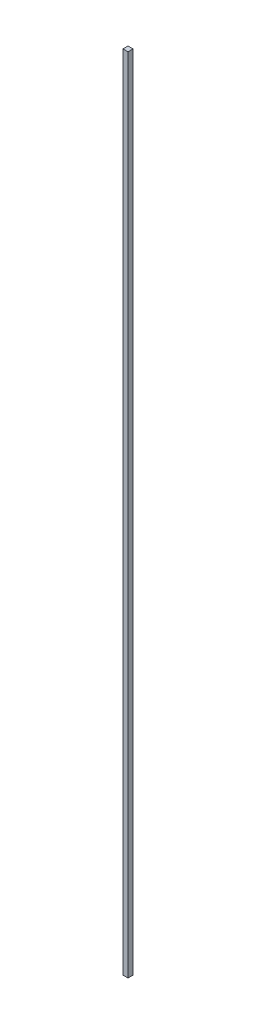
ISO-10303-21;
HEADER;
FILE_DESCRIPTION(('STEP AP214'),'2;1');
FILE_NAME('part.step','',(''),(''),'','','');
FILE_SCHEMA(('AUTOMOTIVE_DESIGN { 1 0 10303 214 1 1 1 1 }'));
ENDSEC;
DATA;
#1=APPLICATION_CONTEXT('core data for automotive mechanical design processes');
#2=APPLICATION_PROTOCOL_DEFINITION('international standard','automotive_design',2000,#1);
#3=PRODUCT_CONTEXT('',#1,'mechanical');
#4=PRODUCT('Part','Part','',(#3));
#5=PRODUCT_RELATED_PRODUCT_CATEGORY('part','',(#4));
#6=PRODUCT_DEFINITION_FORMATION('','',#4);
#7=PRODUCT_DEFINITION_CONTEXT('part definition',#1,'design');
#8=PRODUCT_DEFINITION('design','',#6,#7);
#9=PRODUCT_DEFINITION_SHAPE('','',#8);
#10=(LENGTH_UNIT() NAMED_UNIT(*) SI_UNIT(.MILLI.,.METRE.));
#11=(NAMED_UNIT(*) PLANE_ANGLE_UNIT() SI_UNIT($,.RADIAN.));
#12=(NAMED_UNIT(*) SI_UNIT($,.STERADIAN.) SOLID_ANGLE_UNIT());
#13=UNCERTAINTY_MEASURE_WITH_UNIT(LENGTH_MEASURE(1.E-05),#10,'distance_accuracy_value','');
#14=(GEOMETRIC_REPRESENTATION_CONTEXT(3) GLOBAL_UNCERTAINTY_ASSIGNED_CONTEXT((#13)) GLOBAL_UNIT_ASSIGNED_CONTEXT((#10,
#11,#12)) REPRESENTATION_CONTEXT('',''));
#15=CARTESIAN_POINT('',(0.,0.,0.));
#16=DIRECTION('',(0.,0.,1.));
#17=DIRECTION('',(1.,0.,0.));
#18=AXIS2_PLACEMENT_3D('',#15,#16,#17);
#19=CARTESIAN_POINT('',(-3.2,510.,0.));
#20=DIRECTION('',(1.,0.,0.));
#21=DIRECTION('',(0.,0.,-1.));
#22=AXIS2_PLACEMENT_3D('',#19,#20,#21);
#23=PLANE('',#22);
#24=DIRECTION('',(0.,0.,1.));
#25=VECTOR('',#24,1.);
#26=CARTESIAN_POINT('',(-3.2,0.,0.));
#27=LINE('',#26,#25);
#28=CARTESIAN_POINT('',(-3.2,0.,0.));
#29=VERTEX_POINT('',#28);
#30=CARTESIAN_POINT('',(-3.2,0.,3.2));
#31=VERTEX_POINT('',#30);
#32=EDGE_CURVE('E102',#29,#31,#27,.T.);
#33=ORIENTED_EDGE('',*,*,#32,.T.);
#34=DIRECTION('',(0.,-1.,0.));
#35=VECTOR('',#34,1.);
#36=CARTESIAN_POINT('',(-3.2,510.,3.2));
#37=LINE('',#36,#35);
#38=CARTESIAN_POINT('',(-3.2,510.,3.2));
#39=VERTEX_POINT('',#38);
#40=EDGE_CURVE('E11',#39,#31,#37,.T.);
#41=ORIENTED_EDGE('',*,*,#40,.F.);
#42=DIRECTION('',(0.,0.,1.));
#43=VECTOR('',#42,1.);
#44=CARTESIAN_POINT('',(-3.2,510.,0.));
#45=LINE('',#44,#43);
#46=CARTESIAN_POINT('',(-3.2,510.,0.));
#47=VERTEX_POINT('',#46);
#48=EDGE_CURVE('E90',#47,#39,#45,.T.);
#49=ORIENTED_EDGE('',*,*,#48,.F.);
#50=DIRECTION('',(0.,-1.,0.));
#51=VECTOR('',#50,1.);
#52=CARTESIAN_POINT('',(-3.2,510.,0.));
#53=LINE('',#52,#51);
#54=EDGE_CURVE('E98',#47,#29,#53,.T.);
#55=ORIENTED_EDGE('',*,*,#54,.T.);
#56=EDGE_LOOP('',(#33,#41,#49,#55));
#57=FACE_BOUND('',#56,.T.);
#58=ADVANCED_FACE('F39',(#57),#23,.F.);
#59=CARTESIAN_POINT('',(-3.2,510.,3.2));
#60=DIRECTION('',(0.,0.,-1.));
#61=DIRECTION('',(-1.,0.,0.));
#62=AXIS2_PLACEMENT_3D('',#59,#60,#61);
#63=PLANE('',#62);
#64=DIRECTION('',(1.,0.,0.));
#65=VECTOR('',#64,1.);
#66=CARTESIAN_POINT('',(-3.2,0.,3.2));
#67=LINE('',#66,#65);
#68=CARTESIAN_POINT('',(0.,0.,3.2));
#69=VERTEX_POINT('',#68);
#70=EDGE_CURVE('E94',#31,#69,#67,.T.);
#71=ORIENTED_EDGE('',*,*,#70,.T.);
#72=DIRECTION('',(0.,-1.,0.));
#73=VECTOR('',#72,1.);
#74=CARTESIAN_POINT('',(0.,510.,3.2));
#75=LINE('',#74,#73);
#76=CARTESIAN_POINT('',(0.,510.,3.2));
#77=VERTEX_POINT('',#76);
#78=EDGE_CURVE('E47',#77,#69,#75,.T.);
#79=ORIENTED_EDGE('',*,*,#78,.F.);
#80=DIRECTION('',(1.,0.,0.));
#81=VECTOR('',#80,1.);
#82=CARTESIAN_POINT('',(-3.2,510.,3.2));
#83=LINE('',#82,#81);
#84=EDGE_CURVE('E85',#39,#77,#83,.T.);
#85=ORIENTED_EDGE('',*,*,#84,.F.);
#86=ORIENTED_EDGE('',*,*,#40,.T.);
#87=EDGE_LOOP('',(#71,#79,#85,#86));
#88=FACE_BOUND('',#87,.T.);
#89=ADVANCED_FACE('F93',(#88),#63,.F.);
#90=CARTESIAN_POINT('',(0.,510.,0.));
#91=DIRECTION('',(-1.,0.,0.));
#92=DIRECTION('',(0.,0.,1.));
#93=AXIS2_PLACEMENT_3D('',#90,#91,#92);
#94=PLANE('',#93);
#95=DIRECTION('',(0.,0.,-1.));
#96=VECTOR('',#95,1.);
#97=CARTESIAN_POINT('',(0.,0.,0.));
#98=LINE('',#97,#96);
#99=CARTESIAN_POINT('',(0.,0.,0.));
#100=VERTEX_POINT('',#99);
#101=EDGE_CURVE('E72',#69,#100,#98,.T.);
#102=ORIENTED_EDGE('',*,*,#101,.T.);
#103=DIRECTION('',(0.,-1.,0.));
#104=VECTOR('',#103,1.);
#105=CARTESIAN_POINT('',(0.,510.,0.));
#106=LINE('',#105,#104);
#107=CARTESIAN_POINT('',(0.,510.,0.));
#108=VERTEX_POINT('',#107);
#109=EDGE_CURVE('E95',#108,#100,#106,.T.);
#110=ORIENTED_EDGE('',*,*,#109,.F.);
#111=DIRECTION('',(0.,0.,-1.));
#112=VECTOR('',#111,1.);
#113=CARTESIAN_POINT('',(0.,510.,0.));
#114=LINE('',#113,#112);
#115=EDGE_CURVE('E88',#77,#108,#114,.T.);
#116=ORIENTED_EDGE('',*,*,#115,.F.);
#117=ORIENTED_EDGE('',*,*,#78,.T.);
#118=EDGE_LOOP('',(#102,#110,#116,#117));
#119=FACE_BOUND('',#118,.T.);
#120=ADVANCED_FACE('F96',(#119),#94,.F.);
#121=CARTESIAN_POINT('',(-3.2,510.,0.));
#122=DIRECTION('',(0.,0.,1.));
#123=DIRECTION('',(1.,0.,0.));
#124=AXIS2_PLACEMENT_3D('',#121,#122,#123);
#125=PLANE('',#124);
#126=DIRECTION('',(-1.,0.,0.));
#127=VECTOR('',#126,1.);
#128=CARTESIAN_POINT('',(-3.2,0.,0.));
#129=LINE('',#128,#127);
#130=EDGE_CURVE('E78',#100,#29,#129,.T.);
#131=ORIENTED_EDGE('',*,*,#130,.T.);
#132=ORIENTED_EDGE('',*,*,#54,.F.);
#133=DIRECTION('',(-1.,0.,0.));
#134=VECTOR('',#133,1.);
#135=CARTESIAN_POINT('',(-3.2,510.,0.));
#136=LINE('',#135,#134);
#137=EDGE_CURVE('E55',#108,#47,#136,.T.);
#138=ORIENTED_EDGE('',*,*,#137,.F.);
#139=ORIENTED_EDGE('',*,*,#109,.T.);
#140=EDGE_LOOP('',(#131,#132,#138,#139));
#141=FACE_BOUND('',#140,.T.);
#142=ADVANCED_FACE('F109',(#141),#125,.F.);
#143=CARTESIAN_POINT('',(0.,510.,0.));
#144=DIRECTION('',(0.,1.,0.));
#145=DIRECTION('',(0.,0.,1.));
#146=AXIS2_PLACEMENT_3D('',#143,#144,#145);
#147=PLANE('',#146);
#148=ORIENTED_EDGE('',*,*,#48,.T.);
#149=ORIENTED_EDGE('',*,*,#84,.T.);
#150=ORIENTED_EDGE('',*,*,#115,.T.);
#151=ORIENTED_EDGE('',*,*,#137,.T.);
#152=EDGE_LOOP('',(#148,#149,#150,#151));
#153=FACE_BOUND('',#152,.T.);
#154=ADVANCED_FACE('F86',(#153),#147,.T.);
#155=CARTESIAN_POINT('',(0.,0.,0.));
#156=DIRECTION('',(0.,1.,0.));
#157=DIRECTION('',(0.,0.,1.));
#158=AXIS2_PLACEMENT_3D('',#155,#156,#157);
#159=PLANE('',#158);
#160=ORIENTED_EDGE('',*,*,#32,.F.);
#161=ORIENTED_EDGE('',*,*,#130,.F.);
#162=ORIENTED_EDGE('',*,*,#101,.F.);
#163=ORIENTED_EDGE('',*,*,#70,.F.);
#164=EDGE_LOOP('',(#160,#161,#162,#163));
#165=FACE_BOUND('',#164,.T.);
#166=ADVANCED_FACE('F112',(#165),#159,.F.);
#167=CLOSED_SHELL('',(#58,#89,#120,#142,#154,#166));
#168=MANIFOLD_SOLID_BREP('B2',#167);
#169=ADVANCED_BREP_SHAPE_REPRESENTATION('',(#18,#168),#14);
#170=SHAPE_DEFINITION_REPRESENTATION(#9,#169);
ENDSEC;
END-ISO-10303-21;
